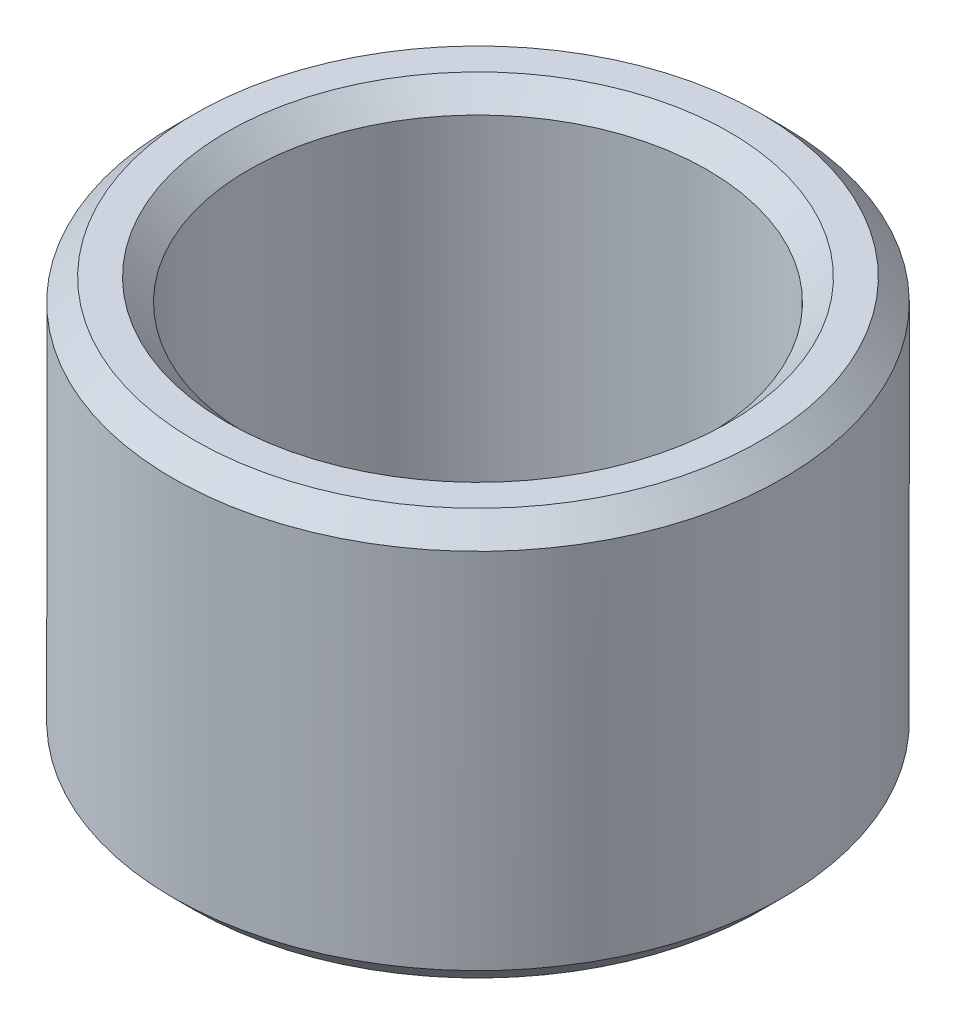
ISO-10303-21;
HEADER;
FILE_DESCRIPTION(('STEP AP214'),'2;1');
FILE_NAME('part.step','',(''),(''),'','','');
FILE_SCHEMA(('AUTOMOTIVE_DESIGN { 1 0 10303 214 1 1 1 1 }'));
ENDSEC;
DATA;
#1=APPLICATION_CONTEXT('core data for automotive mechanical design processes');
#2=APPLICATION_PROTOCOL_DEFINITION('international standard','automotive_design',2000,#1);
#3=PRODUCT_CONTEXT('',#1,'mechanical');
#4=PRODUCT('Part','Part','',(#3));
#5=PRODUCT_RELATED_PRODUCT_CATEGORY('part','',(#4));
#6=PRODUCT_DEFINITION_FORMATION('','',#4);
#7=PRODUCT_DEFINITION_CONTEXT('part definition',#1,'design');
#8=PRODUCT_DEFINITION('design','',#6,#7);
#9=PRODUCT_DEFINITION_SHAPE('','',#8);
#10=(LENGTH_UNIT() NAMED_UNIT(*) SI_UNIT(.MILLI.,.METRE.));
#11=(NAMED_UNIT(*) PLANE_ANGLE_UNIT() SI_UNIT($,.RADIAN.));
#12=(NAMED_UNIT(*) SI_UNIT($,.STERADIAN.) SOLID_ANGLE_UNIT());
#13=UNCERTAINTY_MEASURE_WITH_UNIT(LENGTH_MEASURE(1.E-05),#10,'distance_accuracy_value','');
#14=(GEOMETRIC_REPRESENTATION_CONTEXT(3) GLOBAL_UNCERTAINTY_ASSIGNED_CONTEXT((#13)) GLOBAL_UNIT_ASSIGNED_CONTEXT((#10,
#11,#12)) REPRESENTATION_CONTEXT('',''));
#15=CARTESIAN_POINT('',(0.,0.,0.));
#16=DIRECTION('',(0.,0.,1.));
#17=DIRECTION('',(1.,0.,0.));
#18=AXIS2_PLACEMENT_3D('',#15,#16,#17);
#19=CARTESIAN_POINT('',(0.,13.3388296368045,0.));
#20=DIRECTION('',(0.,-1.,0.));
#21=DIRECTION('',(0.,0.,-1.));
#22=AXIS2_PLACEMENT_3D('',#19,#20,#21);
#23=CYLINDRICAL_SURFACE('',#22,10.);
#24=CARTESIAN_POINT('',(0.,0.716964492420803,0.));
#25=DIRECTION('',(0.,1.,0.));
#26=DIRECTION('',(0.,0.,1.));
#27=AXIS2_PLACEMENT_3D('',#24,#25,#26);
#28=CIRCLE('',#27,10.);
#29=CARTESIAN_POINT('',(0.,0.716964492420801,-10.));
#30=VERTEX_POINT('',#29);
#31=EDGE_CURVE('E10',#30,#30,#28,.T.);
#32=CARTESIAN_POINT('',(0.,12.6218651443837,0.));
#33=DIRECTION('',(0.,1.,0.));
#34=DIRECTION('',(0.,0.,1.));
#35=AXIS2_PLACEMENT_3D('',#32,#33,#34);
#36=CIRCLE('',#35,10.);
#37=CARTESIAN_POINT('',(0.,12.6218651443837,-10.));
#38=VERTEX_POINT('',#37);
#39=EDGE_CURVE('E50',#38,#38,#36,.F.);
#40=CARTESIAN_POINT('',(0.,0.716964492420801,-10.));
#41=CARTESIAN_POINT('',(0.,0.840973874212081,-10.));
#42=CARTESIAN_POINT('',(0.,0.964983256003362,-10.));
#43=CARTESIAN_POINT('',(0.,1.21300201958592,-10.));
#44=CARTESIAN_POINT('',(0.,1.3370114013772,-10.));
#45=CARTESIAN_POINT('',(0.,1.58503016495976,-10.));
#46=CARTESIAN_POINT('',(0.,1.70903954675104,-10.));
#47=CARTESIAN_POINT('',(0.,1.9570583103336,-10.));
#48=CARTESIAN_POINT('',(0.,2.08106769212488,-10.));
#49=CARTESIAN_POINT('',(0.,2.32908645570744,-10.));
#50=CARTESIAN_POINT('',(0.,2.45309583749872,-10.));
#51=CARTESIAN_POINT('',(0.,2.70111460108128,-10.));
#52=CARTESIAN_POINT('',(0.,2.82512398287257,-10.));
#53=CARTESIAN_POINT('',(0.,3.07314274645513,-10.));
#54=CARTESIAN_POINT('',(0.,3.19715212824641,-10.));
#55=CARTESIAN_POINT('',(0.,3.44517089182897,-10.));
#56=CARTESIAN_POINT('',(0.,3.56918027362025,-10.));
#57=CARTESIAN_POINT('',(0.,3.81719903720281,-10.));
#58=CARTESIAN_POINT('',(0.,3.94120841899409,-10.));
#59=CARTESIAN_POINT('',(0.,4.18922718257665,-10.));
#60=CARTESIAN_POINT('',(0.,4.31323656436793,-10.));
#61=CARTESIAN_POINT('',(0.,4.56125532795049,-10.));
#62=CARTESIAN_POINT('',(0.,4.68526470974177,-10.));
#63=CARTESIAN_POINT('',(0.,4.93328347332433,-10.));
#64=CARTESIAN_POINT('',(0.,5.05729285511561,-10.));
#65=CARTESIAN_POINT('',(0.,5.30531161869817,-10.));
#66=CARTESIAN_POINT('',(0.,5.42932100048945,-10.));
#67=CARTESIAN_POINT('',(0.,5.67733976407201,-10.));
#68=CARTESIAN_POINT('',(0.,5.80134914586329,-10.));
#69=CARTESIAN_POINT('',(0.,6.04936790944585,-10.));
#70=CARTESIAN_POINT('',(0.,6.17337729123713,-10.));
#71=CARTESIAN_POINT('',(0.,6.42139605481969,-10.));
#72=CARTESIAN_POINT('',(0.,6.54540543661097,-10.));
#73=CARTESIAN_POINT('',(0.,6.79342420019353,-10.));
#74=CARTESIAN_POINT('',(0.,6.91743358198481,-10.));
#75=CARTESIAN_POINT('',(0.,7.16545234556737,-10.));
#76=CARTESIAN_POINT('',(0.,7.28946172735865,-10.));
#77=CARTESIAN_POINT('',(0.,7.53748049094121,-10.));
#78=CARTESIAN_POINT('',(0.,7.66148987273249,-10.));
#79=CARTESIAN_POINT('',(0.,7.90950863631505,-10.));
#80=CARTESIAN_POINT('',(0.,8.03351801810633,-10.));
#81=CARTESIAN_POINT('',(0.,8.2815367816889,-10.));
#82=CARTESIAN_POINT('',(0.,8.40554616348017,-10.));
#83=CARTESIAN_POINT('',(0.,8.65356492706274,-10.));
#84=CARTESIAN_POINT('',(0.,8.77757430885402,-10.));
#85=CARTESIAN_POINT('',(0.,9.02559307243658,-10.));
#86=CARTESIAN_POINT('',(0.,9.14960245422786,-10.));
#87=CARTESIAN_POINT('',(0.,9.39762121781042,-10.));
#88=CARTESIAN_POINT('',(0.,9.5216305996017,-10.));
#89=CARTESIAN_POINT('',(0.,9.76964936318426,-10.));
#90=CARTESIAN_POINT('',(0.,9.89365874497554,-10.));
#91=CARTESIAN_POINT('',(0.,10.1416775085581,-10.));
#92=CARTESIAN_POINT('',(0.,10.2656868903494,-10.));
#93=CARTESIAN_POINT('',(0.,10.5137056539319,-10.));
#94=CARTESIAN_POINT('',(0.,10.6377150357232,-10.));
#95=CARTESIAN_POINT('',(0.,10.8857337993058,-10.));
#96=CARTESIAN_POINT('',(0.,11.0097431810971,-10.));
#97=CARTESIAN_POINT('',(0.,11.2577619446796,-10.));
#98=CARTESIAN_POINT('',(0.,11.3817713264709,-10.));
#99=CARTESIAN_POINT('',(0.,11.6297900900535,-10.));
#100=CARTESIAN_POINT('',(0.,11.7537994718447,-10.));
#101=CARTESIAN_POINT('',(0.,12.0018182354273,-10.));
#102=CARTESIAN_POINT('',(0.,12.1258276172186,-10.));
#103=CARTESIAN_POINT('',(0.,12.3738463808011,-10.));
#104=CARTESIAN_POINT('',(0.,12.4978557625924,-10.));
#105=CARTESIAN_POINT('',(0.,12.6218651443837,-10.));
#106=B_SPLINE_CURVE_WITH_KNOTS('',3,(#40,#41,#42,#43,#44,#45,#46,#47,#48,#49,#50,#51,#52,#53,
#54,#55,#56,#57,#58,#59,#60,#61,#62,#63,#64,#65,#66,#67,#68,#69,#70,#71,#72,#73,#74,#75,#76,#77,
#78,#79,#80,#81,#82,#83,#84,#85,#86,#87,#88,#89,#90,#91,#92,#93,#94,#95,#96,#97,#98,#99,#100,
#101,#102,#103,#104,#105),.UNSPECIFIED.,.F.,.F.,(4,2,2,2,2,2,2,2,2,2,2,2,2,2,2,2,2,2,2,2,2,2,2,
2,2,2,2,2,2,2,2,2,4),(0.,0.372028145373841,0.744056290747681,1.11608443612152,1.48811258149536,
1.8601407268692,2.23216887224304,2.60419701761689,2.97622516299073,3.34825330836457,
3.72028145373841,4.09230959911225,4.46433774448609,4.83636588985993,5.20839403523377,
5.58042218060761,5.95245032598145,6.32447847135529,6.69650661672913,7.06853476210297,
7.44056290747681,7.81259105285065,8.18461919822449,8.55664734359834,8.92867548897217,
9.30070363434602,9.67273177971986,10.0447599250937,10.4167880704675,10.7888162158414,
11.1608443612152,11.5328725065891,11.9049006519629),.UNSPECIFIED.);
#107=EDGE_CURVE('BSEAM39',#30,#38,#106,.T.);
#108=ORIENTED_EDGE('',*,*,#31,.T.);
#109=ORIENTED_EDGE('',*,*,#39,.T.);
#110=ORIENTED_EDGE('',*,*,#107,.T.);
#111=ORIENTED_EDGE('',*,*,#107,.F.);
#112=EDGE_LOOP('',(#108,#110,#109,#111));
#113=FACE_BOUND('',#112,.T.);
#114=ADVANCED_FACE('F39',(#113),#23,.T.);
#115=CARTESIAN_POINT('',(0.,13.3388296368045,0.));
#116=DIRECTION('',(0.,1.,0.));
#117=DIRECTION('',(0.,0.,1.));
#118=AXIS2_PLACEMENT_3D('',#115,#116,#117);
#119=PLANE('',#118);
#120=CARTESIAN_POINT('',(0.,13.3388296368045,0.));
#121=DIRECTION('',(0.,1.,0.));
#122=DIRECTION('',(0.,0.,1.));
#123=AXIS2_PLACEMENT_3D('',#120,#121,#122);
#124=CIRCLE('',#123,8.24153220720637);
#125=CARTESIAN_POINT('',(0.,13.3388296368045,8.24153220720637));
#126=VERTEX_POINT('',#125);
#127=EDGE_CURVE('E58',#126,#126,#124,.F.);
#128=ORIENTED_EDGE('',*,*,#127,.T.);
#129=EDGE_LOOP('',(#128));
#130=FACE_BOUND('',#129,.T.);
#131=CARTESIAN_POINT('',(0.,13.3388296368045,0.));
#132=DIRECTION('',(0.,1.,0.));
#133=DIRECTION('',(0.,0.,1.));
#134=AXIS2_PLACEMENT_3D('',#131,#132,#133);
#135=CIRCLE('',#134,9.28303550757923);
#136=CARTESIAN_POINT('',(0.,13.3388296368045,-9.28303550757923));
#137=VERTEX_POINT('',#136);
#138=EDGE_CURVE('E61',#137,#137,#135,.T.);
#139=ORIENTED_EDGE('',*,*,#138,.T.);
#140=EDGE_LOOP('',(#139));
#141=FACE_BOUND('',#140,.T.);
#142=ADVANCED_FACE('F88',(#130,#141),#119,.T.);
#143=CARTESIAN_POINT('',(0.,0.,0.));
#144=DIRECTION('',(0.,1.,0.));
#145=DIRECTION('',(0.,0.,1.));
#146=AXIS2_PLACEMENT_3D('',#143,#144,#145);
#147=PLANE('',#146);
#148=CARTESIAN_POINT('',(0.,0.,0.));
#149=DIRECTION('',(0.,1.,0.));
#150=DIRECTION('',(0.,0.,1.));
#151=AXIS2_PLACEMENT_3D('',#148,#149,#150);
#152=CIRCLE('',#151,8.24153220720634);
#153=CARTESIAN_POINT('',(0.,0.,8.24153220720634));
#154=VERTEX_POINT('',#153);
#155=EDGE_CURVE('E51',#154,#154,#152,.T.);
#156=ORIENTED_EDGE('',*,*,#155,.T.);
#157=EDGE_LOOP('',(#156));
#158=FACE_BOUND('',#157,.T.);
#159=CARTESIAN_POINT('',(0.,0.,0.));
#160=DIRECTION('',(0.,1.,0.));
#161=DIRECTION('',(0.,0.,1.));
#162=AXIS2_PLACEMENT_3D('',#159,#160,#161);
#163=CIRCLE('',#162,9.28303550757919);
#164=CARTESIAN_POINT('',(0.,0.,9.28303550757919));
#165=VERTEX_POINT('',#164);
#166=EDGE_CURVE('E54',#165,#165,#163,.F.);
#167=ORIENTED_EDGE('',*,*,#166,.T.);
#168=EDGE_LOOP('',(#167));
#169=FACE_BOUND('',#168,.T.);
#170=ADVANCED_FACE('F83',(#158,#169),#147,.F.);
#171=CARTESIAN_POINT('',(0.,13.3388296368045,0.));
#172=DIRECTION('',(0.,-1.,0.));
#173=DIRECTION('',(0.,0.,-1.));
#174=AXIS2_PLACEMENT_3D('',#171,#172,#173);
#175=CYLINDRICAL_SURFACE('',#174,7.52456771478556);
#176=CARTESIAN_POINT('',(0.,12.6218651443837,0.));
#177=DIRECTION('',(0.,1.,0.));
#178=DIRECTION('',(0.,0.,1.));
#179=AXIS2_PLACEMENT_3D('',#176,#177,#178);
#180=CIRCLE('',#179,7.52456771478556);
#181=CARTESIAN_POINT('',(0.,12.6218651443837,-7.52456771478556));
#182=VERTEX_POINT('',#181);
#183=EDGE_CURVE('E67',#182,#182,#180,.T.);
#184=CARTESIAN_POINT('',(0.,0.71696449242078,0.));
#185=DIRECTION('',(0.,1.,0.));
#186=DIRECTION('',(0.,0.,1.));
#187=AXIS2_PLACEMENT_3D('',#184,#185,#186);
#188=CIRCLE('',#187,7.52456771478556);
#189=CARTESIAN_POINT('',(0.,0.71696449242078,-7.52456771478556));
#190=VERTEX_POINT('',#189);
#191=EDGE_CURVE('E69',#190,#190,#188,.F.);
#192=CARTESIAN_POINT('',(0.,12.6218651443837,-7.52456771478556));
#193=CARTESIAN_POINT('',(0.,12.4978557625924,-7.52456771478556));
#194=CARTESIAN_POINT('',(0.,12.3738463808011,-7.52456771478556));
#195=CARTESIAN_POINT('',(0.,12.1258276172186,-7.52456771478556));
#196=CARTESIAN_POINT('',(0.,12.0018182354273,-7.52456771478556));
#197=CARTESIAN_POINT('',(0.,11.7537994718447,-7.52456771478556));
#198=CARTESIAN_POINT('',(0.,11.6297900900534,-7.52456771478556));
#199=CARTESIAN_POINT('',(0.,11.3817713264709,-7.52456771478556));
#200=CARTESIAN_POINT('',(0.,11.2577619446796,-7.52456771478556));
#201=CARTESIAN_POINT('',(0.,11.009743181097,-7.52456771478556));
#202=CARTESIAN_POINT('',(0.,10.8857337993058,-7.52456771478556));
#203=CARTESIAN_POINT('',(0.,10.6377150357232,-7.52456771478556));
#204=CARTESIAN_POINT('',(0.,10.5137056539319,-7.52456771478556));
#205=CARTESIAN_POINT('',(0.,10.2656868903494,-7.52456771478556));
#206=CARTESIAN_POINT('',(0.,10.1416775085581,-7.52456771478556));
#207=CARTESIAN_POINT('',(0.,9.89365874497551,-7.52456771478556));
#208=CARTESIAN_POINT('',(0.,9.76964936318424,-7.52456771478556));
#209=CARTESIAN_POINT('',(0.,9.52163059960168,-7.52456771478556));
#210=CARTESIAN_POINT('',(0.,9.3976212178104,-7.52456771478556));
#211=CARTESIAN_POINT('',(0.,9.14960245422784,-7.52456771478556));
#212=CARTESIAN_POINT('',(0.,9.02559307243656,-7.52456771478556));
#213=CARTESIAN_POINT('',(0.,8.77757430885399,-7.52456771478556));
#214=CARTESIAN_POINT('',(0.,8.65356492706271,-7.52456771478556));
#215=CARTESIAN_POINT('',(0.,8.40554616348015,-7.52456771478556));
#216=CARTESIAN_POINT('',(0.,8.28153678168887,-7.52456771478556));
#217=CARTESIAN_POINT('',(0.,8.03351801810631,-7.52456771478556));
#218=CARTESIAN_POINT('',(0.,7.90950863631503,-7.52456771478556));
#219=CARTESIAN_POINT('',(0.,7.66148987273247,-7.52456771478556));
#220=CARTESIAN_POINT('',(0.,7.53748049094119,-7.52456771478556));
#221=CARTESIAN_POINT('',(0.,7.28946172735863,-7.52456771478556));
#222=CARTESIAN_POINT('',(0.,7.16545234556735,-7.52456771478556));
#223=CARTESIAN_POINT('',(0.,6.91743358198479,-7.52456771478556));
#224=CARTESIAN_POINT('',(0.,6.79342420019351,-7.52456771478556));
#225=CARTESIAN_POINT('',(0.,6.54540543661095,-7.52456771478556));
#226=CARTESIAN_POINT('',(0.,6.42139605481967,-7.52456771478556));
#227=CARTESIAN_POINT('',(0.,6.17337729123711,-7.52456771478556));
#228=CARTESIAN_POINT('',(0.,6.04936790944583,-7.52456771478556));
#229=CARTESIAN_POINT('',(0.,5.80134914586327,-7.52456771478556));
#230=CARTESIAN_POINT('',(0.,5.67733976407199,-7.52456771478556));
#231=CARTESIAN_POINT('',(0.,5.42932100048943,-7.52456771478556));
#232=CARTESIAN_POINT('',(0.,5.30531161869815,-7.52456771478556));
#233=CARTESIAN_POINT('',(0.,5.05729285511559,-7.52456771478556));
#234=CARTESIAN_POINT('',(0.,4.93328347332431,-7.52456771478556));
#235=CARTESIAN_POINT('',(0.,4.68526470974175,-7.52456771478556));
#236=CARTESIAN_POINT('',(0.,4.56125532795047,-7.52456771478556));
#237=CARTESIAN_POINT('',(0.,4.31323656436791,-7.52456771478556));
#238=CARTESIAN_POINT('',(0.,4.18922718257663,-7.52456771478556));
#239=CARTESIAN_POINT('',(0.,3.94120841899407,-7.52456771478556));
#240=CARTESIAN_POINT('',(0.,3.81719903720279,-7.52456771478556));
#241=CARTESIAN_POINT('',(0.,3.56918027362023,-7.52456771478556));
#242=CARTESIAN_POINT('',(0.,3.44517089182894,-7.52456771478556));
#243=CARTESIAN_POINT('',(0.,3.19715212824638,-7.52456771478556));
#244=CARTESIAN_POINT('',(0.,3.0731427464551,-7.52456771478556));
#245=CARTESIAN_POINT('',(0.,2.82512398287254,-7.52456771478556));
#246=CARTESIAN_POINT('',(0.,2.70111460108126,-7.52456771478556));
#247=CARTESIAN_POINT('',(0.,2.4530958374987,-7.52456771478556));
#248=CARTESIAN_POINT('',(0.,2.32908645570742,-7.52456771478556));
#249=CARTESIAN_POINT('',(0.,2.08106769212486,-7.52456771478556));
#250=CARTESIAN_POINT('',(0.,1.95705831033358,-7.52456771478556));
#251=CARTESIAN_POINT('',(0.,1.70903954675102,-7.52456771478556));
#252=CARTESIAN_POINT('',(0.,1.58503016495974,-7.52456771478556));
#253=CARTESIAN_POINT('',(0.,1.33701140137718,-7.52456771478556));
#254=CARTESIAN_POINT('',(0.,1.2130020195859,-7.52456771478556));
#255=CARTESIAN_POINT('',(0.,0.964983256003341,-7.52456771478556));
#256=CARTESIAN_POINT('',(0.,0.84097387421206,-7.52456771478556));
#257=CARTESIAN_POINT('',(0.,0.71696449242078,-7.52456771478556));
#258=B_SPLINE_CURVE_WITH_KNOTS('',3,(#192,#193,#194,#195,#196,#197,#198,#199,#200,#201,#202,
#203,#204,#205,#206,#207,#208,#209,#210,#211,#212,#213,#214,#215,#216,#217,#218,#219,#220,#221,
#222,#223,#224,#225,#226,#227,#228,#229,#230,#231,#232,#233,#234,#235,#236,#237,#238,#239,#240,
#241,#242,#243,#244,#245,#246,#247,#248,#249,#250,#251,#252,#253,#254,#255,#256,#257),
.UNSPECIFIED.,.F.,.F.,(4,2,2,2,2,2,2,2,2,2,2,2,2,2,2,2,2,2,2,2,2,2,2,2,2,2,2,2,2,2,2,2,4),(0.,
0.37202814537384,0.744056290747681,1.11608443612152,1.48811258149536,1.8601407268692,
2.23216887224304,2.60419701761688,2.97622516299072,3.34825330836456,3.72028145373841,
4.09230959911225,4.46433774448609,4.83636588985993,5.20839403523377,5.58042218060761,
5.95245032598145,6.32447847135529,6.69650661672913,7.06853476210297,7.44056290747681,
7.81259105285065,8.18461919822449,8.55664734359833,8.92867548897217,9.30070363434602,
9.67273177971986,10.0447599250937,10.4167880704675,10.7888162158414,11.1608443612152,
11.5328725065891,11.9049006519629),.UNSPECIFIED.);
#259=EDGE_CURVE('BSEAM71',#182,#190,#258,.T.);
#260=ORIENTED_EDGE('',*,*,#183,.T.);
#261=ORIENTED_EDGE('',*,*,#191,.T.);
#262=ORIENTED_EDGE('',*,*,#259,.T.);
#263=ORIENTED_EDGE('',*,*,#259,.F.);
#264=EDGE_LOOP('',(#260,#262,#261,#263));
#265=FACE_BOUND('',#264,.T.);
#266=ADVANCED_FACE('F71',(#265),#175,.F.);
#267=CARTESIAN_POINT('',(0.,12.6218651443837,0.));
#268=DIRECTION('',(0.,1.,0.));
#269=DIRECTION('',(0.,0.,1.));
#270=AXIS2_PLACEMENT_3D('',#267,#268,#269);
#271=CONICAL_SURFACE('',#270,7.52456771478556,0.785398163397451);
#272=ORIENTED_EDGE('',*,*,#127,.F.);
#273=EDGE_LOOP('',(#272));
#274=FACE_BOUND('',#273,.T.);
#275=ORIENTED_EDGE('',*,*,#183,.F.);
#276=EDGE_LOOP('',(#275));
#277=FACE_BOUND('',#276,.T.);
#278=ADVANCED_FACE('F77',(#274,#277),#271,.F.);
#279=CARTESIAN_POINT('',(0.,0.,0.));
#280=DIRECTION('',(0.,-1.,0.));
#281=DIRECTION('',(0.,0.,-1.));
#282=AXIS2_PLACEMENT_3D('',#279,#280,#281);
#283=CONICAL_SURFACE('',#282,8.24153220720634,0.785398163397443);
#284=ORIENTED_EDGE('',*,*,#191,.F.);
#285=EDGE_LOOP('',(#284));
#286=FACE_BOUND('',#285,.T.);
#287=ORIENTED_EDGE('',*,*,#155,.F.);
#288=EDGE_LOOP('',(#287));
#289=FACE_BOUND('',#288,.T.);
#290=ADVANCED_FACE('F73',(#286,#289),#283,.F.);
#291=CARTESIAN_POINT('',(0.,0.716964492420803,0.));
#292=DIRECTION('',(0.,1.,0.));
#293=DIRECTION('',(0.,0.,1.));
#294=AXIS2_PLACEMENT_3D('',#291,#292,#293);
#295=CONICAL_SURFACE('',#294,10.,0.785398163397452);
#296=ORIENTED_EDGE('',*,*,#166,.F.);
#297=EDGE_LOOP('',(#296));
#298=FACE_BOUND('',#297,.T.);
#299=ORIENTED_EDGE('',*,*,#31,.F.);
#300=EDGE_LOOP('',(#299));
#301=FACE_BOUND('',#300,.T.);
#302=ADVANCED_FACE('F76',(#298,#301),#295,.T.);
#303=CARTESIAN_POINT('',(0.,13.3388296368045,0.));
#304=DIRECTION('',(0.,-1.,0.));
#305=DIRECTION('',(0.,0.,-1.));
#306=AXIS2_PLACEMENT_3D('',#303,#304,#305);
#307=CONICAL_SURFACE('',#306,9.28303550757923,0.785398163397446);
#308=CARTESIAN_POINT('',(0.,12.6218651443837,-10.));
#309=CARTESIAN_POINT('',(0.,12.6293335245131,-9.99253161987062));
#310=CARTESIAN_POINT('',(0.,12.6368019046425,-9.98506323974124));
#311=CARTESIAN_POINT('',(0.,12.6517386649012,-9.97012647948247));
#312=CARTESIAN_POINT('',(0.,12.6592070450306,-9.96265809935309));
#313=CARTESIAN_POINT('',(0.,12.6741438052894,-9.94772133909432));
#314=CARTESIAN_POINT('',(0.,12.6816121854188,-9.94025295896494));
#315=CARTESIAN_POINT('',(0.,12.6965489456775,-9.92531619870617));
#316=CARTESIAN_POINT('',(0.,12.7040173258069,-9.91784781857679));
#317=CARTESIAN_POINT('',(0.,12.7189540860657,-9.90291105831802));
#318=CARTESIAN_POINT('',(0.,12.7264224661951,-9.89544267818864));
#319=CARTESIAN_POINT('',(0.,12.7413592264538,-9.88050591792987));
#320=CARTESIAN_POINT('',(0.,12.7488276065832,-9.87303753780049));
#321=CARTESIAN_POINT('',(0.,12.763764366842,-9.85810077754173));
#322=CARTESIAN_POINT('',(0.,12.7712327469714,-9.85063239741234));
#323=CARTESIAN_POINT('',(0.,12.7861695072301,-9.83569563715358));
#324=CARTESIAN_POINT('',(0.,12.7936378873595,-9.82822725702419));
#325=CARTESIAN_POINT('',(0.,12.8085746476183,-9.81329049676543));
#326=CARTESIAN_POINT('',(0.,12.8160430277477,-9.80582211663604));
#327=CARTESIAN_POINT('',(0.,12.8309797880064,-9.79088535637728));
#328=CARTESIAN_POINT('',(0.,12.8384481681358,-9.78341697624789));
#329=CARTESIAN_POINT('',(0.,12.8533849283946,-9.76848021598913));
#330=CARTESIAN_POINT('',(0.,12.860853308524,-9.76101183585974));
#331=CARTESIAN_POINT('',(0.,12.8757900687827,-9.74607507560098));
#332=CARTESIAN_POINT('',(0.,12.8832584489121,-9.7386066954716));
#333=CARTESIAN_POINT('',(0.,12.8981952091709,-9.72366993521283));
#334=CARTESIAN_POINT('',(0.,12.9056635893003,-9.71620155508345));
#335=CARTESIAN_POINT('',(0.,12.920600349559,-9.70126479482468));
#336=CARTESIAN_POINT('',(0.,12.9280687296884,-9.6937964146953));
#337=CARTESIAN_POINT('',(0.,12.9430054899472,-9.67885965443653));
#338=CARTESIAN_POINT('',(0.,12.9504738700766,-9.67139127430715));
#339=CARTESIAN_POINT('',(0.,12.9654106303353,-9.65645451404838));
#340=CARTESIAN_POINT('',(0.,12.9728790104647,-9.648986133919));
#341=CARTESIAN_POINT('',(0.,12.9878157707235,-9.63404937366023));
#342=CARTESIAN_POINT('',(0.,12.9952841508529,-9.62658099353085));
#343=CARTESIAN_POINT('',(0.,13.0102209111116,-9.61164423327208));
#344=CARTESIAN_POINT('',(0.,13.017689291241,-9.6041758531427));
#345=CARTESIAN_POINT('',(0.,13.0326260514998,-9.58923909288393));
#346=CARTESIAN_POINT('',(0.,13.0400944316292,-9.58177071275455));
#347=CARTESIAN_POINT('',(0.,13.0550311918879,-9.56683395249579));
#348=CARTESIAN_POINT('',(0.,13.0624995720173,-9.5593655723664));
#349=CARTESIAN_POINT('',(0.,13.0774363322761,-9.54442881210764));
#350=CARTESIAN_POINT('',(0.,13.0849047124055,-9.53696043197825));
#351=CARTESIAN_POINT('',(0.,13.0998414726642,-9.52202367171949));
#352=CARTESIAN_POINT('',(0.,13.1073098527936,-9.5145552915901));
#353=CARTESIAN_POINT('',(0.,13.1222466130524,-9.49961853133134));
#354=CARTESIAN_POINT('',(0.,13.1297149931818,-9.49215015120195));
#355=CARTESIAN_POINT('',(0.,13.1446517534405,-9.47721339094319));
#356=CARTESIAN_POINT('',(0.,13.1521201335699,-9.46974501081381));
#357=CARTESIAN_POINT('',(0.,13.1670568938287,-9.45480825055504));
#358=CARTESIAN_POINT('',(0.,13.1745252739581,-9.44733987042566));
#359=CARTESIAN_POINT('',(0.,13.1894620342168,-9.43240311016689));
#360=CARTESIAN_POINT('',(0.,13.1969304143462,-9.42493473003751));
#361=CARTESIAN_POINT('',(0.,13.211867174605,-9.40999796977874));
#362=CARTESIAN_POINT('',(0.,13.2193355547344,-9.40252958964936));
#363=CARTESIAN_POINT('',(0.,13.2342723149931,-9.38759282939059));
#364=CARTESIAN_POINT('',(0.,13.2417406951225,-9.38012444926121));
#365=CARTESIAN_POINT('',(0.,13.2566774553813,-9.36518768900245));
#366=CARTESIAN_POINT('',(0.,13.2641458355107,-9.35771930887306));
#367=CARTESIAN_POINT('',(0.,13.2790825957694,-9.34278254861429));
#368=CARTESIAN_POINT('',(0.,13.2865509758988,-9.33531416848491));
#369=CARTESIAN_POINT('',(0.,13.3014877361576,-9.32037740822615));
#370=CARTESIAN_POINT('',(0.,13.3089561162869,-9.31290902809676));
#371=CARTESIAN_POINT('',(0.,13.3238928765457,-9.297972267838));
#372=CARTESIAN_POINT('',(0.,13.3313612566751,-9.29050388770861));
#373=CARTESIAN_POINT('',(0.,13.3388296368045,-9.28303550757923));
#374=B_SPLINE_CURVE_WITH_KNOTS('',3,(#308,#309,#310,#311,#312,#313,#314,#315,#316,#317,#318,
#319,#320,#321,#322,#323,#324,#325,#326,#327,#328,#329,#330,#331,#332,#333,#334,#335,#336,#337,
#338,#339,#340,#341,#342,#343,#344,#345,#346,#347,#348,#349,#350,#351,#352,#353,#354,#355,#356,
#357,#358,#359,#360,#361,#362,#363,#364,#365,#366,#367,#368,#369,#370,#371,#372,#373),
.UNSPECIFIED.,.F.,.F.,(4,2,2,2,2,2,2,2,2,2,2,2,2,2,2,2,2,2,2,2,2,2,2,2,2,2,2,2,2,2,2,2,4),(0.,
0.0316856534037943,0.0633713068075873,0.0950569602113816,0.126742613615176,0.158428267018969,
0.190113920422763,0.221799573826556,0.25348522723035,0.285170880634145,0.316856534037938,
0.348542187441732,0.380227840845526,0.411913494249319,0.443599147653112,0.475284801056908,
0.506970454460701,0.538656107864494,0.570341761268289,0.602027414672082,0.633713068075875,
0.66539872147967,0.697084374883464,0.728770028287257,0.760455681691051,0.792141335094845,
0.823826988498638,0.855512641902433,0.887198295306226,0.918883948710021,0.950569602113814,
0.982255255517607,1.0139409089214),.UNSPECIFIED.);
#375=EDGE_CURVE('BSEAM45',#38,#137,#374,.T.);
#376=ORIENTED_EDGE('',*,*,#39,.F.);
#377=ORIENTED_EDGE('',*,*,#138,.F.);
#378=ORIENTED_EDGE('',*,*,#375,.T.);
#379=ORIENTED_EDGE('',*,*,#375,.F.);
#380=EDGE_LOOP('',(#376,#378,#377,#379));
#381=FACE_BOUND('',#380,.T.);
#382=ADVANCED_FACE('F45',(#381),#307,.T.);
#383=CLOSED_SHELL('',(#114,#142,#170,#266,#278,#290,#302,#382));
#384=MANIFOLD_SOLID_BREP('B2',#383);
#385=ADVANCED_BREP_SHAPE_REPRESENTATION('',(#18,#384),#14);
#386=SHAPE_DEFINITION_REPRESENTATION(#9,#385);
ENDSEC;
END-ISO-10303-21;
